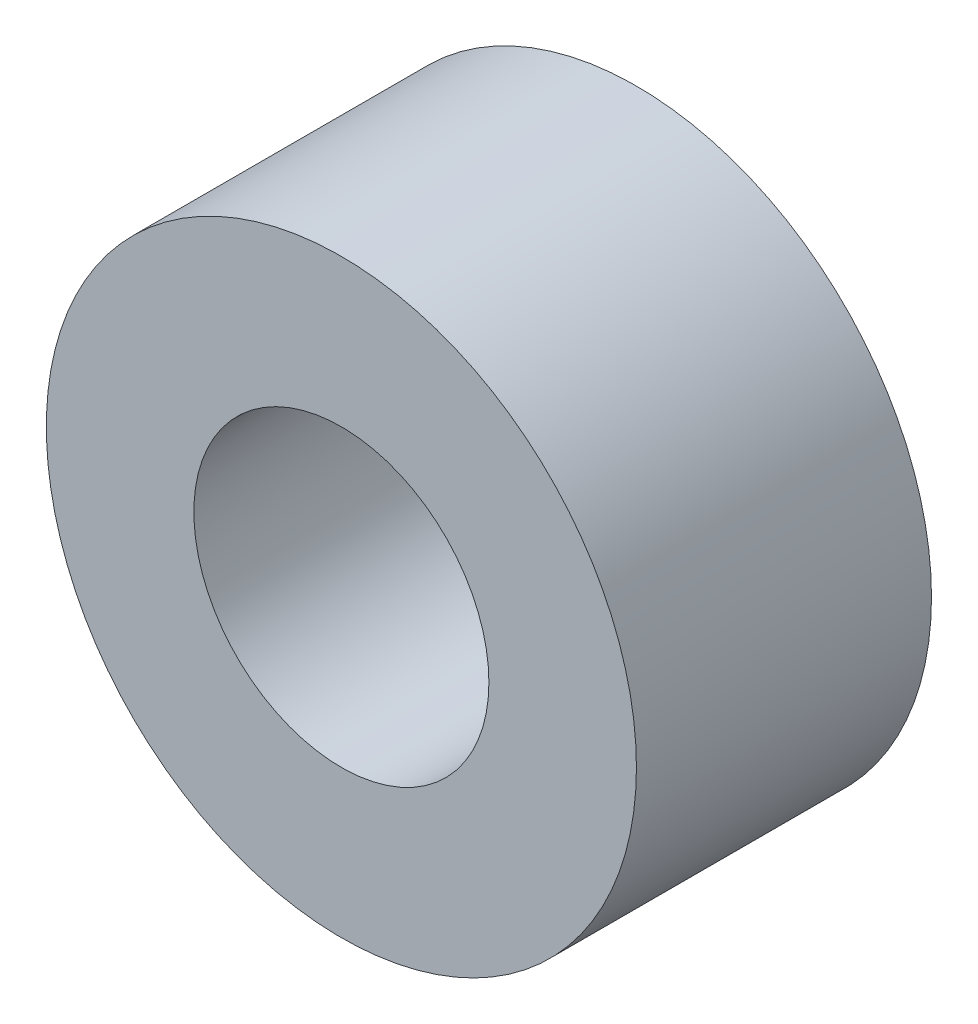
ISO-10303-21;
HEADER;
FILE_DESCRIPTION(('STEP AP214'),'2;1');
FILE_NAME('part.step','',(''),(''),'','','');
FILE_SCHEMA(('AUTOMOTIVE_DESIGN { 1 0 10303 214 1 1 1 1 }'));
ENDSEC;
DATA;
#1=APPLICATION_CONTEXT('core data for automotive mechanical design processes');
#2=APPLICATION_PROTOCOL_DEFINITION('international standard','automotive_design',2000,#1);
#3=PRODUCT_CONTEXT('',#1,'mechanical');
#4=PRODUCT('Part','Part','',(#3));
#5=PRODUCT_RELATED_PRODUCT_CATEGORY('part','',(#4));
#6=PRODUCT_DEFINITION_FORMATION('','',#4);
#7=PRODUCT_DEFINITION_CONTEXT('part definition',#1,'design');
#8=PRODUCT_DEFINITION('design','',#6,#7);
#9=PRODUCT_DEFINITION_SHAPE('','',#8);
#10=(LENGTH_UNIT() NAMED_UNIT(*) SI_UNIT(.MILLI.,.METRE.));
#11=(NAMED_UNIT(*) PLANE_ANGLE_UNIT() SI_UNIT($,.RADIAN.));
#12=(NAMED_UNIT(*) SI_UNIT($,.STERADIAN.) SOLID_ANGLE_UNIT());
#13=UNCERTAINTY_MEASURE_WITH_UNIT(LENGTH_MEASURE(1.E-05),#10,'distance_accuracy_value','');
#14=(GEOMETRIC_REPRESENTATION_CONTEXT(3) GLOBAL_UNCERTAINTY_ASSIGNED_CONTEXT((#13)) GLOBAL_UNIT_ASSIGNED_CONTEXT((#10,
#11,#12)) REPRESENTATION_CONTEXT('',''));
#15=CARTESIAN_POINT('',(0.,0.,0.));
#16=DIRECTION('',(0.,0.,1.));
#17=DIRECTION('',(1.,0.,0.));
#18=AXIS2_PLACEMENT_3D('',#15,#16,#17);
#19=CARTESIAN_POINT('',(0.,0.,12.7));
#20=DIRECTION('',(0.,0.,-1.));
#21=DIRECTION('',(-1.,0.,0.));
#22=AXIS2_PLACEMENT_3D('',#19,#20,#21);
#23=CYLINDRICAL_SURFACE('',#22,12.7);
#24=CARTESIAN_POINT('',(0.,0.,12.7));
#25=DIRECTION('',(0.,0.,1.));
#26=DIRECTION('',(1.,0.,0.));
#27=AXIS2_PLACEMENT_3D('',#24,#25,#26);
#28=CIRCLE('',#27,12.7);
#29=CARTESIAN_POINT('',(12.7,0.,12.7));
#30=VERTEX_POINT('',#29);
#31=EDGE_CURVE('E10',#30,#30,#28,.T.);
#32=ORIENTED_EDGE('',*,*,#31,.F.);
#33=EDGE_LOOP('',(#32));
#34=FACE_BOUND('',#33,.T.);
#35=CARTESIAN_POINT('',(0.,0.,0.));
#36=DIRECTION('',(0.,0.,1.));
#37=DIRECTION('',(1.,0.,0.));
#38=AXIS2_PLACEMENT_3D('',#35,#36,#37);
#39=CIRCLE('',#38,12.7);
#40=CARTESIAN_POINT('',(12.7,0.,0.));
#41=VERTEX_POINT('',#40);
#42=EDGE_CURVE('E33',#41,#41,#39,.T.);
#43=ORIENTED_EDGE('',*,*,#42,.T.);
#44=EDGE_LOOP('',(#43));
#45=FACE_BOUND('',#44,.T.);
#46=ADVANCED_FACE('F30',(#34,#45),#23,.T.);
#47=CARTESIAN_POINT('',(0.,0.,12.7));
#48=DIRECTION('',(0.,0.,1.));
#49=DIRECTION('',(1.,0.,0.));
#50=AXIS2_PLACEMENT_3D('',#47,#48,#49);
#51=PLANE('',#50);
#52=CARTESIAN_POINT('',(0.,0.,12.7));
#53=DIRECTION('',(0.,0.,1.));
#54=DIRECTION('',(1.,0.,0.));
#55=AXIS2_PLACEMENT_3D('',#52,#53,#54);
#56=CIRCLE('',#55,6.35);
#57=CARTESIAN_POINT('',(6.35,0.,12.7));
#58=VERTEX_POINT('',#57);
#59=EDGE_CURVE('E42',#58,#58,#56,.T.);
#60=ORIENTED_EDGE('',*,*,#59,.F.);
#61=EDGE_LOOP('',(#60));
#62=FACE_BOUND('',#61,.T.);
#63=ORIENTED_EDGE('',*,*,#31,.T.);
#64=EDGE_LOOP('',(#63));
#65=FACE_BOUND('',#64,.T.);
#66=ADVANCED_FACE('F57',(#62,#65),#51,.T.);
#67=CARTESIAN_POINT('',(0.,0.,0.));
#68=DIRECTION('',(0.,0.,1.));
#69=DIRECTION('',(1.,0.,0.));
#70=AXIS2_PLACEMENT_3D('',#67,#68,#69);
#71=PLANE('',#70);
#72=CARTESIAN_POINT('',(0.,0.,0.));
#73=DIRECTION('',(0.,0.,1.));
#74=DIRECTION('',(1.,0.,0.));
#75=AXIS2_PLACEMENT_3D('',#72,#73,#74);
#76=CIRCLE('',#75,6.35);
#77=CARTESIAN_POINT('',(6.35,0.,0.));
#78=VERTEX_POINT('',#77);
#79=EDGE_CURVE('E40',#78,#78,#76,.T.);
#80=ORIENTED_EDGE('',*,*,#79,.T.);
#81=EDGE_LOOP('',(#80));
#82=FACE_BOUND('',#81,.T.);
#83=ORIENTED_EDGE('',*,*,#42,.F.);
#84=EDGE_LOOP('',(#83));
#85=FACE_BOUND('',#84,.T.);
#86=ADVANCED_FACE('F48',(#82,#85),#71,.F.);
#87=CARTESIAN_POINT('',(0.,0.,0.));
#88=DIRECTION('',(0.,0.,1.));
#89=DIRECTION('',(1.,0.,0.));
#90=AXIS2_PLACEMENT_3D('',#87,#88,#89);
#91=CYLINDRICAL_SURFACE('',#90,6.35);
#92=ORIENTED_EDGE('',*,*,#79,.F.);
#93=EDGE_LOOP('',(#92));
#94=FACE_BOUND('',#93,.T.);
#95=ORIENTED_EDGE('',*,*,#59,.T.);
#96=EDGE_LOOP('',(#95));
#97=FACE_BOUND('',#96,.T.);
#98=ADVANCED_FACE('F51',(#94,#97),#91,.F.);
#99=CLOSED_SHELL('',(#46,#66,#86,#98));
#100=MANIFOLD_SOLID_BREP('B2',#99);
#101=ADVANCED_BREP_SHAPE_REPRESENTATION('',(#18,#100),#14);
#102=SHAPE_DEFINITION_REPRESENTATION(#9,#101);
ENDSEC;
END-ISO-10303-21;
